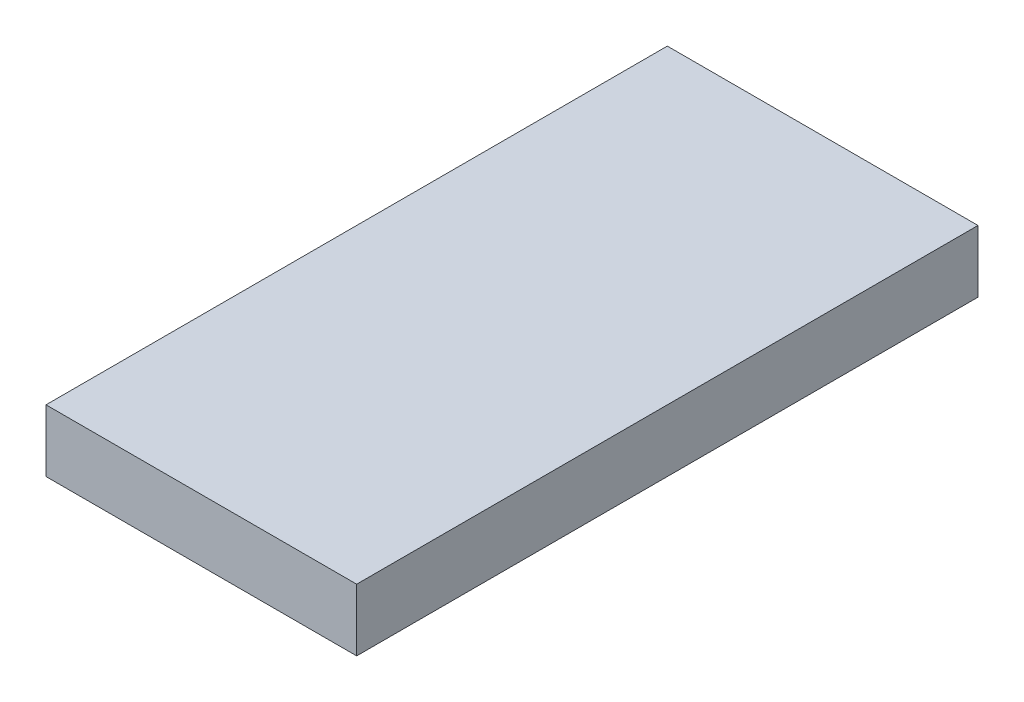
ISO-10303-21;
HEADER;
FILE_DESCRIPTION(('STEP AP214'),'2;1');
FILE_NAME('part.step','',(''),(''),'','','');
FILE_SCHEMA(('AUTOMOTIVE_DESIGN { 1 0 10303 214 1 1 1 1 }'));
ENDSEC;
DATA;
#1=APPLICATION_CONTEXT('core data for automotive mechanical design processes');
#2=APPLICATION_PROTOCOL_DEFINITION('international standard','automotive_design',2000,#1);
#3=PRODUCT_CONTEXT('',#1,'mechanical');
#4=PRODUCT('Part','Part','',(#3));
#5=PRODUCT_RELATED_PRODUCT_CATEGORY('part','',(#4));
#6=PRODUCT_DEFINITION_FORMATION('','',#4);
#7=PRODUCT_DEFINITION_CONTEXT('part definition',#1,'design');
#8=PRODUCT_DEFINITION('design','',#6,#7);
#9=PRODUCT_DEFINITION_SHAPE('','',#8);
#10=(LENGTH_UNIT() NAMED_UNIT(*) SI_UNIT(.MILLI.,.METRE.));
#11=(NAMED_UNIT(*) PLANE_ANGLE_UNIT() SI_UNIT($,.RADIAN.));
#12=(NAMED_UNIT(*) SI_UNIT($,.STERADIAN.) SOLID_ANGLE_UNIT());
#13=UNCERTAINTY_MEASURE_WITH_UNIT(LENGTH_MEASURE(1.E-05),#10,'distance_accuracy_value','');
#14=(GEOMETRIC_REPRESENTATION_CONTEXT(3) GLOBAL_UNCERTAINTY_ASSIGNED_CONTEXT((#13)) GLOBAL_UNIT_ASSIGNED_CONTEXT((#10,
#11,#12)) REPRESENTATION_CONTEXT('',''));
#15=CARTESIAN_POINT('',(0.,0.,0.));
#16=DIRECTION('',(0.,0.,1.));
#17=DIRECTION('',(1.,0.,0.));
#18=AXIS2_PLACEMENT_3D('',#15,#16,#17);
#19=CARTESIAN_POINT('',(-23.0655152915818,5.08,-24.4849316172176));
#20=DIRECTION('',(1.,0.,0.));
#21=DIRECTION('',(0.,0.,-1.));
#22=AXIS2_PLACEMENT_3D('',#19,#20,#21);
#23=PLANE('',#22);
#24=DIRECTION('',(0.,0.,1.));
#25=VECTOR('',#24,1.);
#26=CARTESIAN_POINT('',(-23.0655152915818,0.,-24.4849316172176));
#27=LINE('',#26,#25);
#28=CARTESIAN_POINT('',(-23.0655152915818,0.,-24.4849316172176));
#29=VERTEX_POINT('',#28);
#30=CARTESIAN_POINT('',(-23.0655152915818,0.,26.3150683827824));
#31=VERTEX_POINT('',#30);
#32=EDGE_CURVE('E96',#29,#31,#27,.T.);
#33=ORIENTED_EDGE('',*,*,#32,.T.);
#34=DIRECTION('',(0.,-1.,0.));
#35=VECTOR('',#34,1.);
#36=CARTESIAN_POINT('',(-23.0655152915818,5.08,26.3150683827824));
#37=LINE('',#36,#35);
#38=CARTESIAN_POINT('',(-23.0655152915818,5.08,26.3150683827824));
#39=VERTEX_POINT('',#38);
#40=EDGE_CURVE('E11',#39,#31,#37,.T.);
#41=ORIENTED_EDGE('',*,*,#40,.F.);
#42=DIRECTION('',(0.,0.,1.));
#43=VECTOR('',#42,1.);
#44=CARTESIAN_POINT('',(-23.0655152915818,5.08,-24.4849316172176));
#45=LINE('',#44,#43);
#46=CARTESIAN_POINT('',(-23.0655152915818,5.08,-24.4849316172176));
#47=VERTEX_POINT('',#46);
#48=EDGE_CURVE('E84',#47,#39,#45,.T.);
#49=ORIENTED_EDGE('',*,*,#48,.F.);
#50=DIRECTION('',(0.,-1.,0.));
#51=VECTOR('',#50,1.);
#52=CARTESIAN_POINT('',(-23.0655152915818,5.08,-24.4849316172176));
#53=LINE('',#52,#51);
#54=EDGE_CURVE('E92',#47,#29,#53,.T.);
#55=ORIENTED_EDGE('',*,*,#54,.T.);
#56=EDGE_LOOP('',(#33,#41,#49,#55));
#57=FACE_BOUND('',#56,.T.);
#58=ADVANCED_FACE('F33',(#57),#23,.F.);
#59=CARTESIAN_POINT('',(-23.0655152915818,5.08,26.3150683827824));
#60=DIRECTION('',(0.,0.,-1.));
#61=DIRECTION('',(-1.,0.,0.));
#62=AXIS2_PLACEMENT_3D('',#59,#60,#61);
#63=PLANE('',#62);
#64=DIRECTION('',(1.,0.,0.));
#65=VECTOR('',#64,1.);
#66=CARTESIAN_POINT('',(-23.0655152915818,0.,26.3150683827824));
#67=LINE('',#66,#65);
#68=CARTESIAN_POINT('',(2.3344847084182,0.,26.3150683827824));
#69=VERTEX_POINT('',#68);
#70=EDGE_CURVE('E88',#31,#69,#67,.T.);
#71=ORIENTED_EDGE('',*,*,#70,.T.);
#72=DIRECTION('',(0.,-1.,0.));
#73=VECTOR('',#72,1.);
#74=CARTESIAN_POINT('',(2.3344847084182,5.08,26.3150683827824));
#75=LINE('',#74,#73);
#76=CARTESIAN_POINT('',(2.3344847084182,5.08,26.3150683827824));
#77=VERTEX_POINT('',#76);
#78=EDGE_CURVE('E41',#77,#69,#75,.T.);
#79=ORIENTED_EDGE('',*,*,#78,.F.);
#80=DIRECTION('',(1.,0.,0.));
#81=VECTOR('',#80,1.);
#82=CARTESIAN_POINT('',(-23.0655152915818,5.08,26.3150683827824));
#83=LINE('',#82,#81);
#84=EDGE_CURVE('E79',#39,#77,#83,.T.);
#85=ORIENTED_EDGE('',*,*,#84,.F.);
#86=ORIENTED_EDGE('',*,*,#40,.T.);
#87=EDGE_LOOP('',(#71,#79,#85,#86));
#88=FACE_BOUND('',#87,.T.);
#89=ADVANCED_FACE('F87',(#88),#63,.F.);
#90=CARTESIAN_POINT('',(2.33448470841819,5.08,-24.4849316172176));
#91=DIRECTION('',(-1.,0.,0.));
#92=DIRECTION('',(0.,0.,1.));
#93=AXIS2_PLACEMENT_3D('',#90,#91,#92);
#94=PLANE('',#93);
#95=DIRECTION('',(0.,0.,-1.));
#96=VECTOR('',#95,1.);
#97=CARTESIAN_POINT('',(2.33448470841819,0.,-24.4849316172176));
#98=LINE('',#97,#96);
#99=CARTESIAN_POINT('',(2.33448470841819,0.,-24.4849316172176));
#100=VERTEX_POINT('',#99);
#101=EDGE_CURVE('E66',#69,#100,#98,.T.);
#102=ORIENTED_EDGE('',*,*,#101,.T.);
#103=DIRECTION('',(0.,-1.,0.));
#104=VECTOR('',#103,1.);
#105=CARTESIAN_POINT('',(2.33448470841819,5.08,-24.4849316172176));
#106=LINE('',#105,#104);
#107=CARTESIAN_POINT('',(2.33448470841819,5.08,-24.4849316172176));
#108=VERTEX_POINT('',#107);
#109=EDGE_CURVE('E89',#108,#100,#106,.T.);
#110=ORIENTED_EDGE('',*,*,#109,.F.);
#111=DIRECTION('',(0.,0.,-1.));
#112=VECTOR('',#111,1.);
#113=CARTESIAN_POINT('',(2.33448470841819,5.08,-24.4849316172176));
#114=LINE('',#113,#112);
#115=EDGE_CURVE('E82',#77,#108,#114,.T.);
#116=ORIENTED_EDGE('',*,*,#115,.F.);
#117=ORIENTED_EDGE('',*,*,#78,.T.);
#118=EDGE_LOOP('',(#102,#110,#116,#117));
#119=FACE_BOUND('',#118,.T.);
#120=ADVANCED_FACE('F90',(#119),#94,.F.);
#121=CARTESIAN_POINT('',(-23.0655152915818,5.08,-24.4849316172176));
#122=DIRECTION('',(0.,0.,1.));
#123=DIRECTION('',(1.,0.,0.));
#124=AXIS2_PLACEMENT_3D('',#121,#122,#123);
#125=PLANE('',#124);
#126=DIRECTION('',(-1.,0.,0.));
#127=VECTOR('',#126,1.);
#128=CARTESIAN_POINT('',(-23.0655152915818,0.,-24.4849316172176));
#129=LINE('',#128,#127);
#130=EDGE_CURVE('E72',#100,#29,#129,.T.);
#131=ORIENTED_EDGE('',*,*,#130,.T.);
#132=ORIENTED_EDGE('',*,*,#54,.F.);
#133=DIRECTION('',(-1.,0.,0.));
#134=VECTOR('',#133,1.);
#135=CARTESIAN_POINT('',(-23.0655152915818,5.08,-24.4849316172176));
#136=LINE('',#135,#134);
#137=EDGE_CURVE('E49',#108,#47,#136,.T.);
#138=ORIENTED_EDGE('',*,*,#137,.F.);
#139=ORIENTED_EDGE('',*,*,#109,.T.);
#140=EDGE_LOOP('',(#131,#132,#138,#139));
#141=FACE_BOUND('',#140,.T.);
#142=ADVANCED_FACE('F103',(#141),#125,.F.);
#143=CARTESIAN_POINT('',(-23.0655152915818,5.08,26.3150683827824));
#144=DIRECTION('',(0.,1.,0.));
#145=DIRECTION('',(0.,0.,1.));
#146=AXIS2_PLACEMENT_3D('',#143,#144,#145);
#147=PLANE('',#146);
#148=ORIENTED_EDGE('',*,*,#48,.T.);
#149=ORIENTED_EDGE('',*,*,#84,.T.);
#150=ORIENTED_EDGE('',*,*,#115,.T.);
#151=ORIENTED_EDGE('',*,*,#137,.T.);
#152=EDGE_LOOP('',(#148,#149,#150,#151));
#153=FACE_BOUND('',#152,.T.);
#154=ADVANCED_FACE('F80',(#153),#147,.T.);
#155=CARTESIAN_POINT('',(-23.0655152915818,0.,26.3150683827824));
#156=DIRECTION('',(0.,1.,0.));
#157=DIRECTION('',(0.,0.,1.));
#158=AXIS2_PLACEMENT_3D('',#155,#156,#157);
#159=PLANE('',#158);
#160=ORIENTED_EDGE('',*,*,#32,.F.);
#161=ORIENTED_EDGE('',*,*,#130,.F.);
#162=ORIENTED_EDGE('',*,*,#101,.F.);
#163=ORIENTED_EDGE('',*,*,#70,.F.);
#164=EDGE_LOOP('',(#160,#161,#162,#163));
#165=FACE_BOUND('',#164,.T.);
#166=ADVANCED_FACE('F106',(#165),#159,.F.);
#167=CLOSED_SHELL('',(#58,#89,#120,#142,#154,#166));
#168=MANIFOLD_SOLID_BREP('B2',#167);
#169=ADVANCED_BREP_SHAPE_REPRESENTATION('',(#18,#168),#14);
#170=SHAPE_DEFINITION_REPRESENTATION(#9,#169);
ENDSEC;
END-ISO-10303-21;
